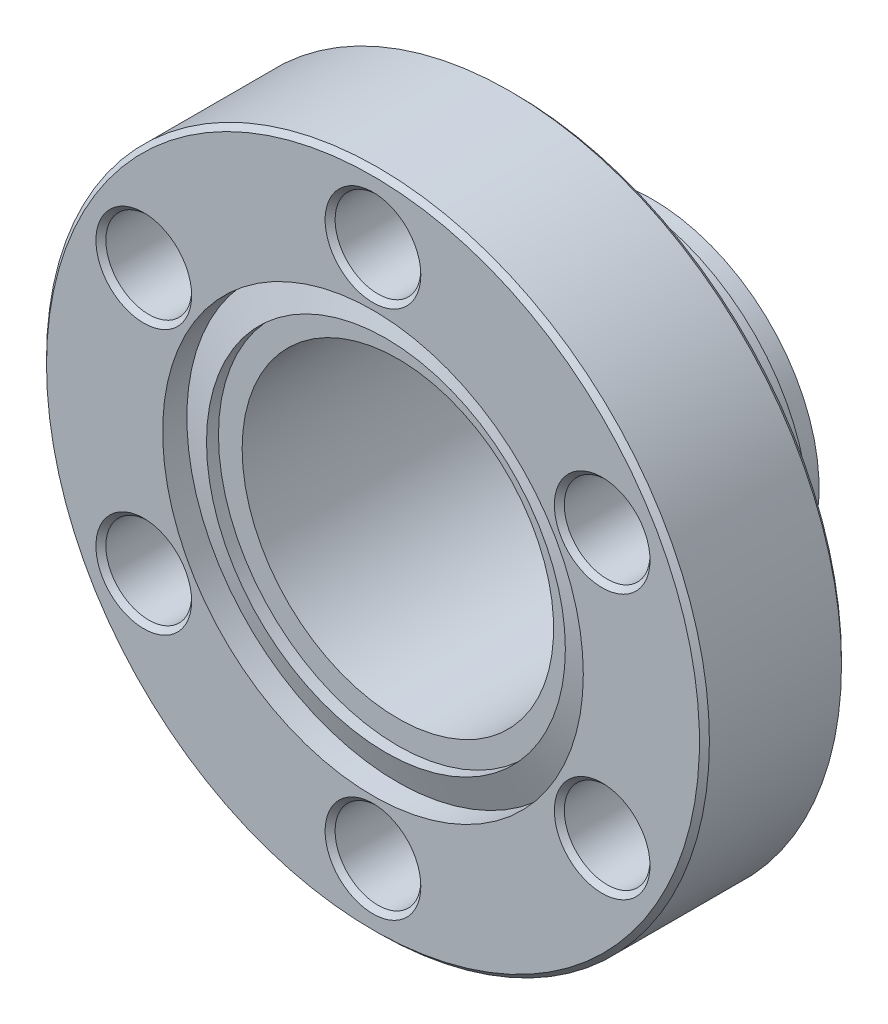
ISO-10303-21;
HEADER;
FILE_DESCRIPTION(('STEP AP214'),'2;1');
FILE_NAME('part.step','',(''),(''),'','','');
FILE_SCHEMA(('AUTOMOTIVE_DESIGN { 1 0 10303 214 1 1 1 1 }'));
ENDSEC;
DATA;
#1=APPLICATION_CONTEXT('core data for automotive mechanical design processes');
#2=APPLICATION_PROTOCOL_DEFINITION('international standard','automotive_design',2000,#1);
#3=PRODUCT_CONTEXT('',#1,'mechanical');
#4=PRODUCT('Part','Part','',(#3));
#5=PRODUCT_RELATED_PRODUCT_CATEGORY('part','',(#4));
#6=PRODUCT_DEFINITION_FORMATION('','',#4);
#7=PRODUCT_DEFINITION_CONTEXT('part definition',#1,'design');
#8=PRODUCT_DEFINITION('design','',#6,#7);
#9=PRODUCT_DEFINITION_SHAPE('','',#8);
#10=(LENGTH_UNIT() NAMED_UNIT(*) SI_UNIT(.MILLI.,.METRE.));
#11=(NAMED_UNIT(*) PLANE_ANGLE_UNIT() SI_UNIT($,.RADIAN.));
#12=(NAMED_UNIT(*) SI_UNIT($,.STERADIAN.) SOLID_ANGLE_UNIT());
#13=UNCERTAINTY_MEASURE_WITH_UNIT(LENGTH_MEASURE(1.E-05),#10,'distance_accuracy_value','');
#14=(GEOMETRIC_REPRESENTATION_CONTEXT(3) GLOBAL_UNCERTAINTY_ASSIGNED_CONTEXT((#13)) GLOBAL_UNIT_ASSIGNED_CONTEXT((#10,
#11,#12)) REPRESENTATION_CONTEXT('',''));
#15=CARTESIAN_POINT('',(0.,0.,0.));
#16=DIRECTION('',(0.,0.,1.));
#17=DIRECTION('',(1.,0.,0.));
#18=AXIS2_PLACEMENT_3D('',#15,#16,#17);
#19=CARTESIAN_POINT('',(0.,0.,-1.3335));
#20=DIRECTION('',(0.,0.,1.));
#21=DIRECTION('',(1.,0.,0.));
#22=AXIS2_PLACEMENT_3D('',#19,#20,#21);
#23=CYLINDRICAL_SURFACE('',#22,9.144);
#24=CARTESIAN_POINT('',(0.,0.,-0.660399999999767));
#25=DIRECTION('',(0.,0.,-1.));
#26=DIRECTION('',(0.,-1.,0.));
#27=AXIS2_PLACEMENT_3D('',#24,#25,#26);
#28=CIRCLE('',#27,9.14400000000008);
#29=CARTESIAN_POINT('',(0.,-9.14400000000008,-0.660399999999767));
#30=VERTEX_POINT('',#29);
#31=EDGE_CURVE('E29',#30,#30,#28,.T.);
#32=ORIENTED_EDGE('',*,*,#31,.F.);
#33=EDGE_LOOP('',(#32));
#34=FACE_BOUND('',#33,.T.);
#35=CARTESIAN_POINT('',(0.,0.,-1.27));
#36=DIRECTION('',(0.,0.,1.));
#37=DIRECTION('',(1.,0.,0.));
#38=AXIS2_PLACEMENT_3D('',#35,#36,#37);
#39=CIRCLE('',#38,9.144);
#40=CARTESIAN_POINT('',(9.144,0.,-1.27));
#41=VERTEX_POINT('',#40);
#42=EDGE_CURVE('E17',#41,#41,#39,.T.);
#43=ORIENTED_EDGE('',*,*,#42,.F.);
#44=EDGE_LOOP('',(#43));
#45=FACE_BOUND('',#44,.T.);
#46=ADVANCED_FACE('F14',(#34,#45),#23,.F.);
#47=CARTESIAN_POINT('',(0.,0.,-1.23358032492253));
#48=DIRECTION('',(0.,0.,-1.));
#49=DIRECTION('',(-1.,0.,0.));
#50=AXIS2_PLACEMENT_3D('',#47,#48,#49);
#51=CONICAL_SURFACE('',#50,10.7187999999999,1.2217304763958);
#52=CARTESIAN_POINT('',(0.,0.,-1.2335803249223));
#53=DIRECTION('',(0.,0.,1.));
#54=DIRECTION('',(1.,0.,0.));
#55=AXIS2_PLACEMENT_3D('',#52,#53,#54);
#56=CIRCLE('',#55,10.7188);
#57=CARTESIAN_POINT('',(10.7188,0.,-1.2335803249223));
#58=VERTEX_POINT('',#57);
#59=EDGE_CURVE('E90',#58,#58,#56,.T.);
#60=ORIENTED_EDGE('',*,*,#59,.T.);
#61=EDGE_LOOP('',(#60));
#62=FACE_BOUND('',#61,.T.);
#63=ORIENTED_EDGE('',*,*,#31,.T.);
#64=EDGE_LOOP('',(#63));
#65=FACE_BOUND('',#64,.T.);
#66=ADVANCED_FACE('F258',(#62,#65),#51,.T.);
#67=CARTESIAN_POINT('',(0.,0.,-1.27));
#68=DIRECTION('',(0.,0.,1.));
#69=DIRECTION('',(1.,0.,0.));
#70=AXIS2_PLACEMENT_3D('',#67,#68,#69);
#71=PLANE('',#70);
#72=CARTESIAN_POINT('',(0.,0.,-1.27));
#73=DIRECTION('',(0.,0.,-1.));
#74=DIRECTION('',(-1.,0.,0.));
#75=AXIS2_PLACEMENT_3D('',#72,#73,#74);
#76=CIRCLE('',#75,7.9375);
#77=CARTESIAN_POINT('',(-7.9375,0.,-1.27));
#78=VERTEX_POINT('',#77);
#79=EDGE_CURVE('E88',#78,#78,#76,.T.);
#80=ORIENTED_EDGE('',*,*,#79,.T.);
#81=EDGE_LOOP('',(#80));
#82=FACE_BOUND('',#81,.T.);
#83=ORIENTED_EDGE('',*,*,#42,.T.);
#84=EDGE_LOOP('',(#83));
#85=FACE_BOUND('',#84,.T.);
#86=ADVANCED_FACE('F255',(#82,#85),#71,.T.);
#87=CARTESIAN_POINT('',(0.,0.,-1.3335));
#88=DIRECTION('',(0.,0.,1.));
#89=DIRECTION('',(1.,0.,0.));
#90=AXIS2_PLACEMENT_3D('',#87,#88,#89);
#91=CYLINDRICAL_SURFACE('',#90,10.7188);
#92=ORIENTED_EDGE('',*,*,#59,.F.);
#93=EDGE_LOOP('',(#92));
#94=FACE_BOUND('',#93,.T.);
#95=CARTESIAN_POINT('',(0.,0.,0.));
#96=DIRECTION('',(0.,0.,1.));
#97=DIRECTION('',(1.,0.,0.));
#98=AXIS2_PLACEMENT_3D('',#95,#96,#97);
#99=CIRCLE('',#98,10.7188);
#100=CARTESIAN_POINT('',(10.7188,0.,0.));
#101=VERTEX_POINT('',#100);
#102=EDGE_CURVE('E86',#101,#101,#99,.T.);
#103=ORIENTED_EDGE('',*,*,#102,.T.);
#104=EDGE_LOOP('',(#103));
#105=FACE_BOUND('',#104,.T.);
#106=ADVANCED_FACE('F251',(#94,#105),#91,.F.);
#107=CARTESIAN_POINT('',(0.,0.,-1.27));
#108=DIRECTION('',(0.,0.,-1.));
#109=DIRECTION('',(-1.,0.,0.));
#110=AXIS2_PLACEMENT_3D('',#107,#108,#109);
#111=CYLINDRICAL_SURFACE('',#110,7.9375);
#112=CARTESIAN_POINT('',(0.,0.,-14.224));
#113=DIRECTION('',(0.,0.,-1.));
#114=DIRECTION('',(-1.,0.,0.));
#115=AXIS2_PLACEMENT_3D('',#112,#113,#114);
#116=CIRCLE('',#115,7.9375);
#117=CARTESIAN_POINT('',(-7.9375,0.,-14.224));
#118=VERTEX_POINT('',#117);
#119=EDGE_CURVE('E83',#118,#118,#116,.F.);
#120=ORIENTED_EDGE('',*,*,#119,.F.);
#121=EDGE_LOOP('',(#120));
#122=FACE_BOUND('',#121,.T.);
#123=ORIENTED_EDGE('',*,*,#79,.F.);
#124=EDGE_LOOP('',(#123));
#125=FACE_BOUND('',#124,.T.);
#126=ADVANCED_FACE('F247',(#122,#125),#111,.F.);
#127=CARTESIAN_POINT('',(0.,0.,0.));
#128=DIRECTION('',(0.,0.,-1.));
#129=DIRECTION('',(-1.,0.,0.));
#130=AXIS2_PLACEMENT_3D('',#127,#128,#129);
#131=PLANE('',#130);
#132=CARTESIAN_POINT('',(-11.6804310310013,6.7437,5.6843418860808E-11));
#133=DIRECTION('',(0.,0.,1.));
#134=DIRECTION('',(1.,0.,0.));
#135=AXIS2_PLACEMENT_3D('',#132,#133,#134);
#136=CIRCLE('',#135,2.43840000009326);
#137=CARTESIAN_POINT('',(-9.24203103090804,6.7437,5.6843418860808E-11));
#138=VERTEX_POINT('',#137);
#139=EDGE_CURVE('E62',#138,#138,#136,.F.);
#140=ORIENTED_EDGE('',*,*,#139,.T.);
#141=EDGE_LOOP('',(#140));
#142=FACE_BOUND('',#141,.T.);
#143=CARTESIAN_POINT('',(-11.6804310310013,-6.7437,5.6843418860808E-11));
#144=DIRECTION('',(0.,0.,1.));
#145=DIRECTION('',(1.,0.,0.));
#146=AXIS2_PLACEMENT_3D('',#143,#144,#145);
#147=CIRCLE('',#146,2.43840000009326);
#148=CARTESIAN_POINT('',(-9.24203103090804,-6.7437,5.6843418860808E-11));
#149=VERTEX_POINT('',#148);
#150=EDGE_CURVE('E65',#149,#149,#147,.F.);
#151=ORIENTED_EDGE('',*,*,#150,.T.);
#152=EDGE_LOOP('',(#151));
#153=FACE_BOUND('',#152,.T.);
#154=CARTESIAN_POINT('',(0.,-13.4874,5.6843418860808E-11));
#155=DIRECTION('',(0.,0.,1.));
#156=DIRECTION('',(1.,0.,0.));
#157=AXIS2_PLACEMENT_3D('',#154,#155,#156);
#158=CIRCLE('',#157,2.43840000001683);
#159=CARTESIAN_POINT('',(2.43840000001683,-13.4874,5.6843418860808E-11));
#160=VERTEX_POINT('',#159);
#161=EDGE_CURVE('E68',#160,#160,#158,.F.);
#162=ORIENTED_EDGE('',*,*,#161,.T.);
#163=EDGE_LOOP('',(#162));
#164=FACE_BOUND('',#163,.T.);
#165=CARTESIAN_POINT('',(11.6804310310013,-6.7437,5.6843418860808E-11));
#166=DIRECTION('',(0.,0.,1.));
#167=DIRECTION('',(1.,0.,0.));
#168=AXIS2_PLACEMENT_3D('',#165,#166,#167);
#169=CIRCLE('',#168,2.43839999999724);
#170=CARTESIAN_POINT('',(14.1188310309985,-6.7437,5.6843418860808E-11));
#171=VERTEX_POINT('',#170);
#172=EDGE_CURVE('E71',#171,#171,#169,.F.);
#173=ORIENTED_EDGE('',*,*,#172,.T.);
#174=EDGE_LOOP('',(#173));
#175=FACE_BOUND('',#174,.T.);
#176=CARTESIAN_POINT('',(11.6804310310013,6.7437,5.6843418860808E-11));
#177=DIRECTION('',(0.,0.,1.));
#178=DIRECTION('',(1.,0.,0.));
#179=AXIS2_PLACEMENT_3D('',#176,#177,#178);
#180=CIRCLE('',#179,2.43839999999724);
#181=CARTESIAN_POINT('',(14.1188310309985,6.7437,5.6843418860808E-11));
#182=VERTEX_POINT('',#181);
#183=EDGE_CURVE('E74',#182,#182,#180,.F.);
#184=ORIENTED_EDGE('',*,*,#183,.T.);
#185=EDGE_LOOP('',(#184));
#186=FACE_BOUND('',#185,.T.);
#187=CARTESIAN_POINT('',(0.,13.4874,5.6843418860808E-11));
#188=DIRECTION('',(0.,0.,1.));
#189=DIRECTION('',(1.,0.,0.));
#190=AXIS2_PLACEMENT_3D('',#187,#188,#189);
#191=CIRCLE('',#190,2.43840000001683);
#192=CARTESIAN_POINT('',(2.43840000001683,13.4874,5.6843418860808E-11));
#193=VERTEX_POINT('',#192);
#194=EDGE_CURVE('E77',#193,#193,#191,.F.);
#195=ORIENTED_EDGE('',*,*,#194,.T.);
#196=EDGE_LOOP('',(#195));
#197=FACE_BOUND('',#196,.T.);
#198=ORIENTED_EDGE('',*,*,#102,.F.);
#199=EDGE_LOOP('',(#198));
#200=FACE_BOUND('',#199,.T.);
#201=CARTESIAN_POINT('',(0.,0.,0.));
#202=DIRECTION('',(0.,0.,-1.));
#203=DIRECTION('',(-1.,0.,0.));
#204=AXIS2_PLACEMENT_3D('',#201,#202,#203);
#205=CIRCLE('',#204,16.637);
#206=CARTESIAN_POINT('',(-16.637,0.,0.));
#207=VERTEX_POINT('',#206);
#208=EDGE_CURVE('E80',#207,#207,#205,.T.);
#209=ORIENTED_EDGE('',*,*,#208,.F.);
#210=EDGE_LOOP('',(#209));
#211=FACE_BOUND('',#210,.T.);
#212=ADVANCED_FACE('F243',(#142,#153,#164,#175,#186,#197,#200,#211),#131,.F.);
#213=CARTESIAN_POINT('',(0.,0.,-14.224));
#214=DIRECTION('',(0.,0.,-1.));
#215=DIRECTION('',(-1.,0.,0.));
#216=AXIS2_PLACEMENT_3D('',#213,#214,#215);
#217=PLANE('',#216);
#218=ORIENTED_EDGE('',*,*,#119,.T.);
#219=EDGE_LOOP('',(#218));
#220=FACE_BOUND('',#219,.T.);
#221=CARTESIAN_POINT('',(0.,0.,-14.224));
#222=DIRECTION('',(0.,0.,-1.));
#223=DIRECTION('',(-1.,0.,0.));
#224=AXIS2_PLACEMENT_3D('',#221,#222,#223);
#225=CIRCLE('',#224,8.509);
#226=CARTESIAN_POINT('',(-8.509,0.,-14.224));
#227=VERTEX_POINT('',#226);
#228=EDGE_CURVE('E58',#227,#227,#225,.F.);
#229=ORIENTED_EDGE('',*,*,#228,.F.);
#230=EDGE_LOOP('',(#229));
#231=FACE_BOUND('',#230,.T.);
#232=ADVANCED_FACE('F239',(#220,#231),#217,.T.);
#233=CARTESIAN_POINT('',(0.,0.,-0.254000000000019));
#234=DIRECTION('',(0.,0.,-1.));
#235=DIRECTION('',(-1.,0.,0.));
#236=AXIS2_PLACEMENT_3D('',#233,#234,#235);
#237=CONICAL_SURFACE('',#236,16.891,0.785398163397301);
#238=CARTESIAN_POINT('',(0.,0.,-0.254));
#239=DIRECTION('',(0.,0.,-1.));
#240=DIRECTION('',(-1.,0.,0.));
#241=AXIS2_PLACEMENT_3D('',#238,#239,#240);
#242=CIRCLE('',#241,16.891);
#243=CARTESIAN_POINT('',(-16.891,0.,-0.254));
#244=VERTEX_POINT('',#243);
#245=EDGE_CURVE('E61',#244,#244,#242,.T.);
#246=ORIENTED_EDGE('',*,*,#245,.F.);
#247=EDGE_LOOP('',(#246));
#248=FACE_BOUND('',#247,.T.);
#249=ORIENTED_EDGE('',*,*,#208,.T.);
#250=EDGE_LOOP('',(#249));
#251=FACE_BOUND('',#250,.T.);
#252=ADVANCED_FACE('F235',(#248,#251),#237,.T.);
#253=CARTESIAN_POINT('',(0.,13.4874,-5.6843418860808E-11));
#254=DIRECTION('',(0.,0.,1.));
#255=DIRECTION('',(1.,0.,0.));
#256=AXIS2_PLACEMENT_3D('',#253,#254,#255);
#257=CONICAL_SURFACE('',#256,2.43839999990314,0.785398163397448);
#258=CARTESIAN_POINT('',(0.,13.4874,-0.254));
#259=DIRECTION('',(0.,0.,-1.));
#260=DIRECTION('',(-1.,0.,0.));
#261=AXIS2_PLACEMENT_3D('',#258,#259,#260);
#262=CIRCLE('',#261,2.1844);
#263=CARTESIAN_POINT('',(-2.1844,13.4874,-0.254));
#264=VERTEX_POINT('',#263);
#265=EDGE_CURVE('E100',#264,#264,#262,.T.);
#266=ORIENTED_EDGE('',*,*,#265,.T.);
#267=EDGE_LOOP('',(#266));
#268=FACE_BOUND('',#267,.T.);
#269=ORIENTED_EDGE('',*,*,#194,.F.);
#270=EDGE_LOOP('',(#269));
#271=FACE_BOUND('',#270,.T.);
#272=ADVANCED_FACE('F231',(#268,#271),#257,.F.);
#273=CARTESIAN_POINT('',(11.6804310310013,6.7437,0.));
#274=DIRECTION('',(0.,0.,1.));
#275=DIRECTION('',(1.,0.,0.));
#276=AXIS2_PLACEMENT_3D('',#273,#274,#275);
#277=CONICAL_SURFACE('',#276,2.43839999994039,0.785398163397448);
#278=CARTESIAN_POINT('',(11.6804310310013,6.7437,-0.254));
#279=DIRECTION('',(0.,0.,-1.));
#280=DIRECTION('',(-1.,0.,0.));
#281=AXIS2_PLACEMENT_3D('',#278,#279,#280);
#282=CIRCLE('',#281,2.1844);
#283=CARTESIAN_POINT('',(9.4960310310013,6.7437,-0.254));
#284=VERTEX_POINT('',#283);
#285=EDGE_CURVE('E103',#284,#284,#282,.T.);
#286=ORIENTED_EDGE('',*,*,#285,.T.);
#287=EDGE_LOOP('',(#286));
#288=FACE_BOUND('',#287,.T.);
#289=ORIENTED_EDGE('',*,*,#183,.F.);
#290=EDGE_LOOP('',(#289));
#291=FACE_BOUND('',#290,.T.);
#292=ADVANCED_FACE('F227',(#288,#291),#277,.F.);
#293=CARTESIAN_POINT('',(11.6804310310013,-6.7437,0.));
#294=DIRECTION('',(0.,0.,1.));
#295=DIRECTION('',(1.,0.,0.));
#296=AXIS2_PLACEMENT_3D('',#293,#294,#295);
#297=CONICAL_SURFACE('',#296,2.43839999994039,0.785398163397448);
#298=CARTESIAN_POINT('',(11.6804310310013,-6.7437,-0.254));
#299=DIRECTION('',(0.,0.,-1.));
#300=DIRECTION('',(-1.,0.,0.));
#301=AXIS2_PLACEMENT_3D('',#298,#299,#300);
#302=CIRCLE('',#301,2.1844);
#303=CARTESIAN_POINT('',(9.4960310310013,-6.7437,-0.254));
#304=VERTEX_POINT('',#303);
#305=EDGE_CURVE('E106',#304,#304,#302,.T.);
#306=ORIENTED_EDGE('',*,*,#305,.T.);
#307=EDGE_LOOP('',(#306));
#308=FACE_BOUND('',#307,.T.);
#309=ORIENTED_EDGE('',*,*,#172,.F.);
#310=EDGE_LOOP('',(#309));
#311=FACE_BOUND('',#310,.T.);
#312=ADVANCED_FACE('F223',(#308,#311),#297,.F.);
#313=CARTESIAN_POINT('',(0.,-13.4874,-5.6843418860808E-11));
#314=DIRECTION('',(0.,0.,1.));
#315=DIRECTION('',(1.,0.,0.));
#316=AXIS2_PLACEMENT_3D('',#313,#314,#315);
#317=CONICAL_SURFACE('',#316,2.43839999990314,0.785398163397448);
#318=CARTESIAN_POINT('',(0.,-13.4874,-0.254));
#319=DIRECTION('',(0.,0.,-1.));
#320=DIRECTION('',(-1.,0.,0.));
#321=AXIS2_PLACEMENT_3D('',#318,#319,#320);
#322=CIRCLE('',#321,2.1844);
#323=CARTESIAN_POINT('',(-2.1844,-13.4874,-0.254));
#324=VERTEX_POINT('',#323);
#325=EDGE_CURVE('E109',#324,#324,#322,.T.);
#326=ORIENTED_EDGE('',*,*,#325,.T.);
#327=EDGE_LOOP('',(#326));
#328=FACE_BOUND('',#327,.T.);
#329=ORIENTED_EDGE('',*,*,#161,.F.);
#330=EDGE_LOOP('',(#329));
#331=FACE_BOUND('',#330,.T.);
#332=ADVANCED_FACE('F219',(#328,#331),#317,.F.);
#333=CARTESIAN_POINT('',(-11.6804310310013,-6.7437,5.6843418860808E-11));
#334=DIRECTION('',(0.,0.,1.));
#335=DIRECTION('',(1.,0.,0.));
#336=AXIS2_PLACEMENT_3D('',#333,#334,#335);
#337=CONICAL_SURFACE('',#336,2.43840000009326,0.785398163397448);
#338=CARTESIAN_POINT('',(-11.6804310310013,-6.7437,-0.254));
#339=DIRECTION('',(0.,0.,-1.));
#340=DIRECTION('',(-1.,0.,0.));
#341=AXIS2_PLACEMENT_3D('',#338,#339,#340);
#342=CIRCLE('',#341,2.1844);
#343=CARTESIAN_POINT('',(-13.8648310310013,-6.7437,-0.254));
#344=VERTEX_POINT('',#343);
#345=EDGE_CURVE('E112',#344,#344,#342,.T.);
#346=ORIENTED_EDGE('',*,*,#345,.T.);
#347=EDGE_LOOP('',(#346));
#348=FACE_BOUND('',#347,.T.);
#349=ORIENTED_EDGE('',*,*,#150,.F.);
#350=EDGE_LOOP('',(#349));
#351=FACE_BOUND('',#350,.T.);
#352=ADVANCED_FACE('F215',(#348,#351),#337,.F.);
#353=CARTESIAN_POINT('',(-11.6804310310013,6.7437,5.6843418860808E-11));
#354=DIRECTION('',(0.,0.,1.));
#355=DIRECTION('',(1.,0.,0.));
#356=AXIS2_PLACEMENT_3D('',#353,#354,#355);
#357=CONICAL_SURFACE('',#356,2.43840000009326,0.785398163397448);
#358=CARTESIAN_POINT('',(-11.6804310310013,6.7437,-0.254));
#359=DIRECTION('',(0.,0.,-1.));
#360=DIRECTION('',(-1.,0.,0.));
#361=AXIS2_PLACEMENT_3D('',#358,#359,#360);
#362=CIRCLE('',#361,2.1844);
#363=CARTESIAN_POINT('',(-13.8648310310013,6.7437,-0.254));
#364=VERTEX_POINT('',#363);
#365=EDGE_CURVE('E57',#364,#364,#362,.T.);
#366=ORIENTED_EDGE('',*,*,#365,.T.);
#367=EDGE_LOOP('',(#366));
#368=FACE_BOUND('',#367,.T.);
#369=ORIENTED_EDGE('',*,*,#139,.F.);
#370=EDGE_LOOP('',(#369));
#371=FACE_BOUND('',#370,.T.);
#372=ADVANCED_FACE('F211',(#368,#371),#357,.F.);
#373=CARTESIAN_POINT('',(0.,0.,-6.88975));
#374=DIRECTION('',(0.,0.,-1.));
#375=DIRECTION('',(-1.,0.,0.));
#376=AXIS2_PLACEMENT_3D('',#373,#374,#375);
#377=CYLINDRICAL_SURFACE('',#376,8.509);
#378=CARTESIAN_POINT('',(0.,0.,-12.7));
#379=DIRECTION('',(0.,0.,-1.));
#380=DIRECTION('',(-1.,0.,0.));
#381=AXIS2_PLACEMENT_3D('',#378,#379,#380);
#382=CIRCLE('',#381,8.509);
#383=CARTESIAN_POINT('',(-8.509,0.,-12.7));
#384=VERTEX_POINT('',#383);
#385=EDGE_CURVE('E53',#384,#384,#382,.F.);
#386=ORIENTED_EDGE('',*,*,#385,.F.);
#387=EDGE_LOOP('',(#386));
#388=FACE_BOUND('',#387,.T.);
#389=ORIENTED_EDGE('',*,*,#228,.T.);
#390=EDGE_LOOP('',(#389));
#391=FACE_BOUND('',#390,.T.);
#392=ADVANCED_FACE('F207',(#388,#391),#377,.T.);
#393=CARTESIAN_POINT('',(0.,0.,0.));
#394=DIRECTION('',(0.,0.,-1.));
#395=DIRECTION('',(-1.,0.,0.));
#396=AXIS2_PLACEMENT_3D('',#393,#394,#395);
#397=CYLINDRICAL_SURFACE('',#396,16.891);
#398=CARTESIAN_POINT('',(0.,0.,-6.98499999999998));
#399=DIRECTION('',(0.,0.,1.));
#400=DIRECTION('',(0.,1.,0.));
#401=AXIS2_PLACEMENT_3D('',#398,#399,#400);
#402=CIRCLE('',#401,16.891);
#403=CARTESIAN_POINT('',(0.,16.891,-6.98499999999998));
#404=VERTEX_POINT('',#403);
#405=EDGE_CURVE('E56',#404,#404,#402,.F.);
#406=ORIENTED_EDGE('',*,*,#405,.F.);
#407=EDGE_LOOP('',(#406));
#408=FACE_BOUND('',#407,.T.);
#409=ORIENTED_EDGE('',*,*,#245,.T.);
#410=EDGE_LOOP('',(#409));
#411=FACE_BOUND('',#410,.T.);
#412=ADVANCED_FACE('F203',(#408,#411),#397,.T.);
#413=CARTESIAN_POINT('',(0.,13.4874,0.));
#414=DIRECTION('',(0.,0.,-1.));
#415=DIRECTION('',(-1.,0.,0.));
#416=AXIS2_PLACEMENT_3D('',#413,#414,#415);
#417=CYLINDRICAL_SURFACE('',#416,2.1844);
#418=CARTESIAN_POINT('',(0.,13.4874,-6.98499999998603));
#419=DIRECTION('',(0.,0.,-1.));
#420=DIRECTION('',(-1.,0.,0.));
#421=AXIS2_PLACEMENT_3D('',#418,#419,#420);
#422=CIRCLE('',#421,2.18439999991915);
#423=CARTESIAN_POINT('',(-2.18439999991915,13.4874,-6.98499999998603));
#424=VERTEX_POINT('',#423);
#425=EDGE_CURVE('E119',#424,#424,#422,.T.);
#426=ORIENTED_EDGE('',*,*,#425,.T.);
#427=EDGE_LOOP('',(#426));
#428=FACE_BOUND('',#427,.T.);
#429=ORIENTED_EDGE('',*,*,#265,.F.);
#430=EDGE_LOOP('',(#429));
#431=FACE_BOUND('',#430,.T.);
#432=ADVANCED_FACE('F199',(#428,#431),#417,.F.);
#433=CARTESIAN_POINT('',(11.6804310310013,6.7437,0.));
#434=DIRECTION('',(0.,0.,-1.));
#435=DIRECTION('',(-1.,0.,0.));
#436=AXIS2_PLACEMENT_3D('',#433,#434,#435);
#437=CYLINDRICAL_SURFACE('',#436,2.1844);
#438=CARTESIAN_POINT('',(11.6804310310013,6.7437,-6.98499999998603));
#439=DIRECTION('',(0.,0.,-1.));
#440=DIRECTION('',(-1.,0.,0.));
#441=AXIS2_PLACEMENT_3D('',#438,#439,#440);
#442=CIRCLE('',#441,2.18439999993874);
#443=CARTESIAN_POINT('',(9.49603103106256,6.7437,-6.98499999998603));
#444=VERTEX_POINT('',#443);
#445=EDGE_CURVE('E122',#444,#444,#442,.T.);
#446=ORIENTED_EDGE('',*,*,#445,.T.);
#447=EDGE_LOOP('',(#446));
#448=FACE_BOUND('',#447,.T.);
#449=ORIENTED_EDGE('',*,*,#285,.F.);
#450=EDGE_LOOP('',(#449));
#451=FACE_BOUND('',#450,.T.);
#452=ADVANCED_FACE('F195',(#448,#451),#437,.F.);
#453=CARTESIAN_POINT('',(11.6804310310013,-6.7437,0.));
#454=DIRECTION('',(0.,0.,-1.));
#455=DIRECTION('',(-1.,0.,0.));
#456=AXIS2_PLACEMENT_3D('',#453,#454,#455);
#457=CYLINDRICAL_SURFACE('',#456,2.1844);
#458=CARTESIAN_POINT('',(11.6804310310013,-6.7437,-6.98499999998603));
#459=DIRECTION('',(0.,0.,-1.));
#460=DIRECTION('',(-1.,0.,0.));
#461=AXIS2_PLACEMENT_3D('',#458,#459,#460);
#462=CIRCLE('',#461,2.18439999993874);
#463=CARTESIAN_POINT('',(9.49603103106256,-6.7437,-6.98499999998603));
#464=VERTEX_POINT('',#463);
#465=EDGE_CURVE('E125',#464,#464,#462,.T.);
#466=ORIENTED_EDGE('',*,*,#465,.T.);
#467=EDGE_LOOP('',(#466));
#468=FACE_BOUND('',#467,.T.);
#469=ORIENTED_EDGE('',*,*,#305,.F.);
#470=EDGE_LOOP('',(#469));
#471=FACE_BOUND('',#470,.T.);
#472=ADVANCED_FACE('F191',(#468,#471),#457,.F.);
#473=CARTESIAN_POINT('',(0.,-13.4874,0.));
#474=DIRECTION('',(0.,0.,-1.));
#475=DIRECTION('',(-1.,0.,0.));
#476=AXIS2_PLACEMENT_3D('',#473,#474,#475);
#477=CYLINDRICAL_SURFACE('',#476,2.1844);
#478=CARTESIAN_POINT('',(0.,-13.4874,-6.98499999998603));
#479=DIRECTION('',(0.,0.,-1.));
#480=DIRECTION('',(-1.,0.,0.));
#481=AXIS2_PLACEMENT_3D('',#478,#479,#480);
#482=CIRCLE('',#481,2.18439999991915);
#483=CARTESIAN_POINT('',(-2.18439999991915,-13.4874,-6.98499999998603));
#484=VERTEX_POINT('',#483);
#485=EDGE_CURVE('E128',#484,#484,#482,.T.);
#486=ORIENTED_EDGE('',*,*,#485,.T.);
#487=EDGE_LOOP('',(#486));
#488=FACE_BOUND('',#487,.T.);
#489=ORIENTED_EDGE('',*,*,#325,.F.);
#490=EDGE_LOOP('',(#489));
#491=FACE_BOUND('',#490,.T.);
#492=ADVANCED_FACE('F187',(#488,#491),#477,.F.);
#493=CARTESIAN_POINT('',(-11.6804310310013,-6.7437,0.));
#494=DIRECTION('',(0.,0.,-1.));
#495=DIRECTION('',(-1.,0.,0.));
#496=AXIS2_PLACEMENT_3D('',#493,#494,#495);
#497=CYLINDRICAL_SURFACE('',#496,2.1844);
#498=CARTESIAN_POINT('',(-11.6804310310013,-6.7437,-6.98500000004287));
#499=DIRECTION('',(0.,0.,-1.));
#500=DIRECTION('',(-1.,0.,0.));
#501=AXIS2_PLACEMENT_3D('',#498,#499,#500);
#502=CIRCLE('',#501,2.1843999999564);
#503=CARTESIAN_POINT('',(-13.8648310309577,-6.7437,-6.98500000004287));
#504=VERTEX_POINT('',#503);
#505=EDGE_CURVE('E131',#504,#504,#502,.T.);
#506=ORIENTED_EDGE('',*,*,#505,.T.);
#507=EDGE_LOOP('',(#506));
#508=FACE_BOUND('',#507,.T.);
#509=ORIENTED_EDGE('',*,*,#345,.F.);
#510=EDGE_LOOP('',(#509));
#511=FACE_BOUND('',#510,.T.);
#512=ADVANCED_FACE('F184',(#508,#511),#497,.F.);
#513=CARTESIAN_POINT('',(-11.6804310310013,6.7437,0.));
#514=DIRECTION('',(0.,0.,-1.));
#515=DIRECTION('',(-1.,0.,0.));
#516=AXIS2_PLACEMENT_3D('',#513,#514,#515);
#517=CYLINDRICAL_SURFACE('',#516,2.1844);
#518=CARTESIAN_POINT('',(-11.6804310310013,6.7437,-6.98500000004287));
#519=DIRECTION('',(0.,0.,-1.));
#520=DIRECTION('',(-1.,0.,0.));
#521=AXIS2_PLACEMENT_3D('',#518,#519,#520);
#522=CIRCLE('',#521,2.1843999999564);
#523=CARTESIAN_POINT('',(-13.8648310309577,6.7437,-6.98500000004287));
#524=VERTEX_POINT('',#523);
#525=EDGE_CURVE('E52',#524,#524,#522,.T.);
#526=ORIENTED_EDGE('',*,*,#525,.T.);
#527=EDGE_LOOP('',(#526));
#528=FACE_BOUND('',#527,.T.);
#529=ORIENTED_EDGE('',*,*,#365,.F.);
#530=EDGE_LOOP('',(#529));
#531=FACE_BOUND('',#530,.T.);
#532=ADVANCED_FACE('F137',(#528,#531),#517,.F.);
#533=CARTESIAN_POINT('',(0.,0.,-12.7));
#534=DIRECTION('',(0.,0.,-1.));
#535=DIRECTION('',(-1.,0.,0.));
#536=AXIS2_PLACEMENT_3D('',#533,#534,#535);
#537=PLANE('',#536);
#538=ORIENTED_EDGE('',*,*,#385,.T.);
#539=EDGE_LOOP('',(#538));
#540=FACE_BOUND('',#539,.T.);
#541=CARTESIAN_POINT('',(0.,0.,-12.7));
#542=DIRECTION('',(0.,0.,-1.));
#543=DIRECTION('',(-1.,0.,0.));
#544=AXIS2_PLACEMENT_3D('',#541,#542,#543);
#545=CIRCLE('',#544,9.4996);
#546=CARTESIAN_POINT('',(-9.4996,0.,-12.7));
#547=VERTEX_POINT('',#546);
#548=EDGE_CURVE('E49',#547,#547,#545,.F.);
#549=ORIENTED_EDGE('',*,*,#548,.F.);
#550=EDGE_LOOP('',(#549));
#551=FACE_BOUND('',#550,.T.);
#552=ADVANCED_FACE('F167',(#540,#551),#537,.T.);
#553=CARTESIAN_POINT('',(0.,0.,-6.98499999999998));
#554=DIRECTION('',(0.,0.,1.));
#555=DIRECTION('',(1.,0.,0.));
#556=AXIS2_PLACEMENT_3D('',#553,#554,#555);
#557=CONICAL_SURFACE('',#556,16.891,0.7853981633973);
#558=ORIENTED_EDGE('',*,*,#405,.T.);
#559=EDGE_LOOP('',(#558));
#560=FACE_BOUND('',#559,.T.);
#561=CARTESIAN_POINT('',(0.,0.,-7.23900000000002));
#562=DIRECTION('',(0.,0.,1.));
#563=DIRECTION('',(1.,0.,0.));
#564=AXIS2_PLACEMENT_3D('',#561,#562,#563);
#565=CIRCLE('',#564,16.637);
#566=CARTESIAN_POINT('',(16.637,0.,-7.23900000000002));
#567=VERTEX_POINT('',#566);
#568=EDGE_CURVE('E46',#567,#567,#565,.F.);
#569=ORIENTED_EDGE('',*,*,#568,.F.);
#570=EDGE_LOOP('',(#569));
#571=FACE_BOUND('',#570,.T.);
#572=ADVANCED_FACE('F164',(#560,#571),#557,.T.);
#573=CARTESIAN_POINT('',(0.,13.4874,-7.23899999991318));
#574=DIRECTION('',(0.,0.,-1.));
#575=DIRECTION('',(-1.,0.,0.));
#576=AXIS2_PLACEMENT_3D('',#573,#574,#575);
#577=CONICAL_SURFACE('',#576,2.4383999998463,0.785398163397448);
#578=ORIENTED_EDGE('',*,*,#425,.F.);
#579=EDGE_LOOP('',(#578));
#580=FACE_BOUND('',#579,.T.);
#581=CARTESIAN_POINT('',(0.,13.4874,-7.23899999997002));
#582=DIRECTION('',(0.,0.,-1.));
#583=DIRECTION('',(-1.,0.,0.));
#584=AXIS2_PLACEMENT_3D('',#581,#582,#583);
#585=CIRCLE('',#584,2.43839999990314);
#586=CARTESIAN_POINT('',(-2.43839999990314,13.4874,-7.23899999997002));
#587=VERTEX_POINT('',#586);
#588=EDGE_CURVE('E43',#587,#587,#585,.F.);
#589=ORIENTED_EDGE('',*,*,#588,.F.);
#590=EDGE_LOOP('',(#589));
#591=FACE_BOUND('',#590,.T.);
#592=ADVANCED_FACE('F166',(#580,#591),#577,.F.);
#593=CARTESIAN_POINT('',(11.6804310310013,6.7437,-7.23899999991318));
#594=DIRECTION('',(0.,0.,-1.));
#595=DIRECTION('',(-1.,0.,0.));
#596=AXIS2_PLACEMENT_3D('',#593,#594,#595);
#597=CONICAL_SURFACE('',#596,2.43839999986589,0.785398163397448);
#598=ORIENTED_EDGE('',*,*,#445,.F.);
#599=EDGE_LOOP('',(#598));
#600=FACE_BOUND('',#599,.T.);
#601=CARTESIAN_POINT('',(11.6804310310013,6.7437,-7.23899999997002));
#602=DIRECTION('',(0.,0.,-1.));
#603=DIRECTION('',(-1.,0.,0.));
#604=AXIS2_PLACEMENT_3D('',#601,#602,#603);
#605=CIRCLE('',#604,2.43839999992273);
#606=CARTESIAN_POINT('',(9.24203103107857,6.7437,-7.23899999997002));
#607=VERTEX_POINT('',#606);
#608=EDGE_CURVE('E40',#607,#607,#605,.F.);
#609=ORIENTED_EDGE('',*,*,#608,.F.);
#610=EDGE_LOOP('',(#609));
#611=FACE_BOUND('',#610,.T.);
#612=ADVANCED_FACE('F175',(#600,#611),#597,.F.);
#613=CARTESIAN_POINT('',(11.6804310310013,-6.7437,-7.23899999991318));
#614=DIRECTION('',(0.,0.,-1.));
#615=DIRECTION('',(-1.,0.,0.));
#616=AXIS2_PLACEMENT_3D('',#613,#614,#615);
#617=CONICAL_SURFACE('',#616,2.43839999986589,0.785398163397448);
#618=ORIENTED_EDGE('',*,*,#465,.F.);
#619=EDGE_LOOP('',(#618));
#620=FACE_BOUND('',#619,.T.);
#621=CARTESIAN_POINT('',(11.6804310310013,-6.7437,-7.23899999997002));
#622=DIRECTION('',(0.,0.,-1.));
#623=DIRECTION('',(-1.,0.,0.));
#624=AXIS2_PLACEMENT_3D('',#621,#622,#623);
#625=CIRCLE('',#624,2.43839999992273);
#626=CARTESIAN_POINT('',(9.24203103107857,-6.7437,-7.23899999997002));
#627=VERTEX_POINT('',#626);
#628=EDGE_CURVE('E37',#627,#627,#625,.F.);
#629=ORIENTED_EDGE('',*,*,#628,.F.);
#630=EDGE_LOOP('',(#629));
#631=FACE_BOUND('',#630,.T.);
#632=ADVANCED_FACE('F376',(#620,#631),#617,.F.);
#633=CARTESIAN_POINT('',(0.,-13.4874,-7.23899999991318));
#634=DIRECTION('',(0.,0.,-1.));
#635=DIRECTION('',(-1.,0.,0.));
#636=AXIS2_PLACEMENT_3D('',#633,#634,#635);
#637=CONICAL_SURFACE('',#636,2.4383999998463,0.785398163397448);
#638=ORIENTED_EDGE('',*,*,#485,.F.);
#639=EDGE_LOOP('',(#638));
#640=FACE_BOUND('',#639,.T.);
#641=CARTESIAN_POINT('',(0.,-13.4874,-7.23899999997002));
#642=DIRECTION('',(0.,0.,-1.));
#643=DIRECTION('',(-1.,0.,0.));
#644=AXIS2_PLACEMENT_3D('',#641,#642,#643);
#645=CIRCLE('',#644,2.43839999990314);
#646=CARTESIAN_POINT('',(-2.43839999990314,-13.4874,-7.23899999997002));
#647=VERTEX_POINT('',#646);
#648=EDGE_CURVE('E34',#647,#647,#645,.F.);
#649=ORIENTED_EDGE('',*,*,#648,.F.);
#650=EDGE_LOOP('',(#649));
#651=FACE_BOUND('',#650,.T.);
#652=ADVANCED_FACE('F383',(#640,#651),#637,.F.);
#653=CARTESIAN_POINT('',(-11.6804310310013,-6.7437,-7.23900000002686));
#654=DIRECTION('',(0.,0.,-1.));
#655=DIRECTION('',(0.,1.,0.));
#656=AXIS2_PLACEMENT_3D('',#653,#654,#655);
#657=CONICAL_SURFACE('',#656,2.43839999994039,0.785398163397448);
#658=ORIENTED_EDGE('',*,*,#505,.F.);
#659=EDGE_LOOP('',(#658));
#660=FACE_BOUND('',#659,.T.);
#661=CARTESIAN_POINT('',(-11.6804310310013,-6.7437,-7.23900000008371));
#662=DIRECTION('',(0.,0.,-1.));
#663=DIRECTION('',(0.,1.,0.));
#664=AXIS2_PLACEMENT_3D('',#661,#662,#663);
#665=CIRCLE('',#664,2.43839999999724);
#666=CARTESIAN_POINT('',(-11.6804310310013,-4.30530000000276,-7.23900000008371));
#667=VERTEX_POINT('',#666);
#668=EDGE_CURVE('E26',#667,#667,#665,.F.);
#669=ORIENTED_EDGE('',*,*,#668,.F.);
#670=EDGE_LOOP('',(#669));
#671=FACE_BOUND('',#670,.T.);
#672=ADVANCED_FACE('F144',(#660,#671),#657,.F.);
#673=CARTESIAN_POINT('',(-11.6804310310013,6.7437,-7.23900000002686));
#674=DIRECTION('',(0.,0.,-1.));
#675=DIRECTION('',(0.,1.,0.));
#676=AXIS2_PLACEMENT_3D('',#673,#674,#675);
#677=CONICAL_SURFACE('',#676,2.43839999994039,0.785398163397448);
#678=ORIENTED_EDGE('',*,*,#525,.F.);
#679=EDGE_LOOP('',(#678));
#680=FACE_BOUND('',#679,.T.);
#681=CARTESIAN_POINT('',(-11.6804310310013,6.7437,-7.23900000008371));
#682=DIRECTION('',(0.,0.,-1.));
#683=DIRECTION('',(0.,1.,0.));
#684=AXIS2_PLACEMENT_3D('',#681,#682,#683);
#685=CIRCLE('',#684,2.43839999999724);
#686=CARTESIAN_POINT('',(-11.6804310310013,9.18209999999723,-7.23900000008371));
#687=VERTEX_POINT('',#686);
#688=EDGE_CURVE('E21',#687,#687,#685,.F.);
#689=ORIENTED_EDGE('',*,*,#688,.F.);
#690=EDGE_LOOP('',(#689));
#691=FACE_BOUND('',#690,.T.);
#692=ADVANCED_FACE('F140',(#680,#691),#677,.F.);
#693=CARTESIAN_POINT('',(0.,0.,-6.88975));
#694=DIRECTION('',(0.,0.,-1.));
#695=DIRECTION('',(-1.,0.,0.));
#696=AXIS2_PLACEMENT_3D('',#693,#694,#695);
#697=CYLINDRICAL_SURFACE('',#696,9.4996);
#698=ORIENTED_EDGE('',*,*,#548,.T.);
#699=EDGE_LOOP('',(#698));
#700=FACE_BOUND('',#699,.T.);
#701=CARTESIAN_POINT('',(0.,0.,-7.239));
#702=DIRECTION('',(0.,0.,-1.));
#703=DIRECTION('',(-1.,0.,0.));
#704=AXIS2_PLACEMENT_3D('',#701,#702,#703);
#705=CIRCLE('',#704,9.4996);
#706=CARTESIAN_POINT('',(-9.4996,0.,-7.239));
#707=VERTEX_POINT('',#706);
#708=EDGE_CURVE('E10',#707,#707,#705,.F.);
#709=ORIENTED_EDGE('',*,*,#708,.F.);
#710=EDGE_LOOP('',(#709));
#711=FACE_BOUND('',#710,.T.);
#712=ADVANCED_FACE('F143',(#700,#711),#697,.T.);
#713=CARTESIAN_POINT('',(0.,0.,-7.239));
#714=DIRECTION('',(0.,0.,-1.));
#715=DIRECTION('',(-1.,0.,0.));
#716=AXIS2_PLACEMENT_3D('',#713,#714,#715);
#717=PLANE('',#716);
#718=ORIENTED_EDGE('',*,*,#708,.T.);
#719=EDGE_LOOP('',(#718));
#720=FACE_BOUND('',#719,.T.);
#721=ORIENTED_EDGE('',*,*,#688,.T.);
#722=EDGE_LOOP('',(#721));
#723=FACE_BOUND('',#722,.T.);
#724=ORIENTED_EDGE('',*,*,#668,.T.);
#725=EDGE_LOOP('',(#724));
#726=FACE_BOUND('',#725,.T.);
#727=ORIENTED_EDGE('',*,*,#648,.T.);
#728=EDGE_LOOP('',(#727));
#729=FACE_BOUND('',#728,.T.);
#730=ORIENTED_EDGE('',*,*,#628,.T.);
#731=EDGE_LOOP('',(#730));
#732=FACE_BOUND('',#731,.T.);
#733=ORIENTED_EDGE('',*,*,#608,.T.);
#734=EDGE_LOOP('',(#733));
#735=FACE_BOUND('',#734,.T.);
#736=ORIENTED_EDGE('',*,*,#588,.T.);
#737=EDGE_LOOP('',(#736));
#738=FACE_BOUND('',#737,.T.);
#739=ORIENTED_EDGE('',*,*,#568,.T.);
#740=EDGE_LOOP('',(#739));
#741=FACE_BOUND('',#740,.T.);
#742=ADVANCED_FACE('F148',(#720,#723,#726,#729,#732,#735,#738,#741),#717,.T.);
#743=CLOSED_SHELL('',(#46,#66,#86,#106,#126,#212,#232,#252,#272,#292,#312,#332,#352,#372,#392,
#412,#432,#452,#472,#492,#512,#532,#552,#572,#592,#612,#632,#652,#672,#692,#712,#742));
#744=MANIFOLD_SOLID_BREP('B1',#743);
#745=ADVANCED_BREP_SHAPE_REPRESENTATION('',(#18,#744),#14);
#746=SHAPE_DEFINITION_REPRESENTATION(#9,#745);
ENDSEC;
END-ISO-10303-21;
